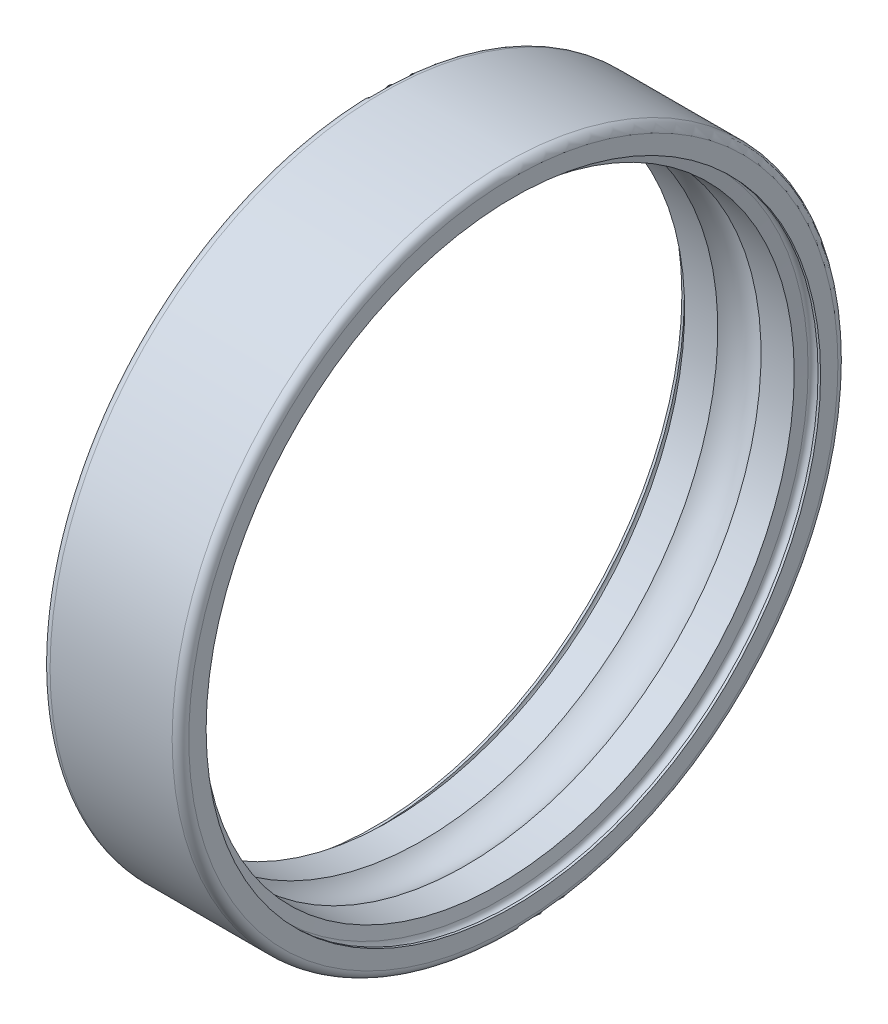
ISO-10303-21;
HEADER;
FILE_DESCRIPTION(('STEP AP214'),'2;1');
FILE_NAME('part.step','',(''),(''),'','','');
FILE_SCHEMA(('AUTOMOTIVE_DESIGN { 1 0 10303 214 1 1 1 1 }'));
ENDSEC;
DATA;
#1=APPLICATION_CONTEXT('core data for automotive mechanical design processes');
#2=APPLICATION_PROTOCOL_DEFINITION('international standard','automotive_design',2000,#1);
#3=PRODUCT_CONTEXT('',#1,'mechanical');
#4=PRODUCT('Part','Part','',(#3));
#5=PRODUCT_RELATED_PRODUCT_CATEGORY('part','',(#4));
#6=PRODUCT_DEFINITION_FORMATION('','',#4);
#7=PRODUCT_DEFINITION_CONTEXT('part definition',#1,'design');
#8=PRODUCT_DEFINITION('design','',#6,#7);
#9=PRODUCT_DEFINITION_SHAPE('','',#8);
#10=(LENGTH_UNIT() NAMED_UNIT(*) SI_UNIT(.MILLI.,.METRE.));
#11=(NAMED_UNIT(*) PLANE_ANGLE_UNIT() SI_UNIT($,.RADIAN.));
#12=(NAMED_UNIT(*) SI_UNIT($,.STERADIAN.) SOLID_ANGLE_UNIT());
#13=UNCERTAINTY_MEASURE_WITH_UNIT(LENGTH_MEASURE(1.E-05),#10,'distance_accuracy_value','');
#14=(GEOMETRIC_REPRESENTATION_CONTEXT(3) GLOBAL_UNCERTAINTY_ASSIGNED_CONTEXT((#13)) GLOBAL_UNIT_ASSIGNED_CONTEXT((#10,
#11,#12)) REPRESENTATION_CONTEXT('',''));
#15=CARTESIAN_POINT('',(0.,0.,0.));
#16=DIRECTION('',(0.,0.,1.));
#17=DIRECTION('',(1.,0.,0.));
#18=AXIS2_PLACEMENT_3D('',#15,#16,#17);
#19=CARTESIAN_POINT('',(2.5,0.,0.));
#20=DIRECTION('',(1.,0.,0.));
#21=DIRECTION('',(0.,0.,-1.));
#22=AXIS2_PLACEMENT_3D('',#19,#20,#21);
#23=TOROIDAL_SURFACE('',#22,9.75000000000001,1.1905);
#24=CARTESIAN_POINT('',(3.27928829710191,0.,0.));
#25=DIRECTION('',(-1.,0.,0.));
#26=DIRECTION('',(0.,0.,1.));
#27=AXIS2_PLACEMENT_3D('',#24,#25,#26);
#28=CIRCLE('',#27,10.65);
#29=CARTESIAN_POINT('',(3.27928829710191,0.,10.65));
#30=VERTEX_POINT('',#29);
#31=EDGE_CURVE('E123',#30,#30,#28,.F.);
#32=ORIENTED_EDGE('',*,*,#31,.T.);
#33=EDGE_LOOP('',(#32));
#34=FACE_BOUND('',#33,.T.);
#35=CARTESIAN_POINT('',(1.72071170289809,0.,0.));
#36=DIRECTION('',(-1.,0.,0.));
#37=DIRECTION('',(0.,0.,1.));
#38=AXIS2_PLACEMENT_3D('',#35,#36,#37);
#39=CIRCLE('',#38,10.65);
#40=CARTESIAN_POINT('',(1.72071170289809,0.,10.65));
#41=VERTEX_POINT('',#40);
#42=EDGE_CURVE('E128',#41,#41,#39,.T.);
#43=ORIENTED_EDGE('',*,*,#42,.T.);
#44=EDGE_LOOP('',(#43));
#45=FACE_BOUND('',#44,.T.);
#46=ADVANCED_FACE('F14',(#34,#45),#23,.F.);
#47=CARTESIAN_POINT('',(50.,0.,0.));
#48=DIRECTION('',(-1.,0.,0.));
#49=DIRECTION('',(0.,0.,1.));
#50=AXIS2_PLACEMENT_3D('',#47,#48,#49);
#51=CYLINDRICAL_SURFACE('',#50,10.65);
#52=CARTESIAN_POINT('',(0.524938966801098,0.,0.));
#53=DIRECTION('',(-1.,0.,0.));
#54=DIRECTION('',(0.,0.,1.));
#55=AXIS2_PLACEMENT_3D('',#52,#53,#54);
#56=CIRCLE('',#55,10.65);
#57=CARTESIAN_POINT('',(0.524938966801098,0.,10.65));
#58=VERTEX_POINT('',#57);
#59=EDGE_CURVE('E118',#58,#58,#56,.T.);
#60=ORIENTED_EDGE('',*,*,#59,.T.);
#61=EDGE_LOOP('',(#60));
#62=FACE_BOUND('',#61,.T.);
#63=ORIENTED_EDGE('',*,*,#42,.F.);
#64=EDGE_LOOP('',(#63));
#65=FACE_BOUND('',#64,.T.);
#66=ADVANCED_FACE('F242',(#62,#65),#51,.F.);
#67=CARTESIAN_POINT('',(50.,0.,0.));
#68=DIRECTION('',(-1.,0.,0.));
#69=DIRECTION('',(0.,0.,1.));
#70=AXIS2_PLACEMENT_3D('',#67,#68,#69);
#71=CYLINDRICAL_SURFACE('',#70,10.65);
#72=ORIENTED_EDGE('',*,*,#31,.F.);
#73=EDGE_LOOP('',(#72));
#74=FACE_BOUND('',#73,.T.);
#75=CARTESIAN_POINT('',(4.4750610331989,0.,0.));
#76=DIRECTION('',(1.,0.,0.));
#77=DIRECTION('',(0.,0.,-1.));
#78=AXIS2_PLACEMENT_3D('',#75,#76,#77);
#79=CIRCLE('',#78,10.65);
#80=CARTESIAN_POINT('',(4.4750610331989,0.,-10.65));
#81=VERTEX_POINT('',#80);
#82=EDGE_CURVE('E113',#81,#81,#79,.T.);
#83=ORIENTED_EDGE('',*,*,#82,.T.);
#84=EDGE_LOOP('',(#83));
#85=FACE_BOUND('',#84,.T.);
#86=ADVANCED_FACE('F232',(#74,#85),#71,.F.);
#87=CARTESIAN_POINT('',(0.449999999999999,0.,0.));
#88=DIRECTION('',(-1.,0.,0.));
#89=DIRECTION('',(0.,0.,1.));
#90=AXIS2_PLACEMENT_3D('',#87,#88,#89);
#91=CONICAL_SURFACE('',#90,11.075,1.39626340159546);
#92=CARTESIAN_POINT('',(0.45,0.,0.));
#93=DIRECTION('',(1.,0.,0.));
#94=DIRECTION('',(0.,0.,-1.));
#95=AXIS2_PLACEMENT_3D('',#92,#93,#94);
#96=CIRCLE('',#95,11.075);
#97=CARTESIAN_POINT('',(0.45,0.,-11.075));
#98=VERTEX_POINT('',#97);
#99=EDGE_CURVE('E107',#98,#98,#96,.F.);
#100=ORIENTED_EDGE('',*,*,#99,.T.);
#101=EDGE_LOOP('',(#100));
#102=FACE_BOUND('',#101,.T.);
#103=ORIENTED_EDGE('',*,*,#59,.F.);
#104=EDGE_LOOP('',(#103));
#105=FACE_BOUND('',#104,.T.);
#106=ADVANCED_FACE('F166',(#102,#105),#91,.F.);
#107=CARTESIAN_POINT('',(4.55,0.,0.));
#108=DIRECTION('',(1.,0.,0.));
#109=DIRECTION('',(0.,0.,-1.));
#110=AXIS2_PLACEMENT_3D('',#107,#108,#109);
#111=CONICAL_SURFACE('',#110,11.075,1.39626340159547);
#112=ORIENTED_EDGE('',*,*,#82,.F.);
#113=EDGE_LOOP('',(#112));
#114=FACE_BOUND('',#113,.T.);
#115=CARTESIAN_POINT('',(4.55,0.,0.));
#116=DIRECTION('',(1.,0.,0.));
#117=DIRECTION('',(0.,0.,-1.));
#118=AXIS2_PLACEMENT_3D('',#115,#116,#117);
#119=CIRCLE('',#118,11.075);
#120=CARTESIAN_POINT('',(4.55,0.,-11.075));
#121=VERTEX_POINT('',#120);
#122=EDGE_CURVE('E103',#121,#121,#119,.T.);
#123=ORIENTED_EDGE('',*,*,#122,.T.);
#124=EDGE_LOOP('',(#123));
#125=FACE_BOUND('',#124,.T.);
#126=ADVANCED_FACE('F160',(#114,#125),#111,.F.);
#127=CARTESIAN_POINT('',(0.27,0.,0.));
#128=DIRECTION('',(1.,0.,0.));
#129=DIRECTION('',(0.,0.,-1.));
#130=AXIS2_PLACEMENT_3D('',#127,#128,#129);
#131=TOROIDAL_SURFACE('',#130,11.075,0.18);
#132=ORIENTED_EDGE('',*,*,#99,.F.);
#133=EDGE_LOOP('',(#132));
#134=FACE_BOUND('',#133,.T.);
#135=CARTESIAN_POINT('',(0.0899999999999998,0.,0.));
#136=DIRECTION('',(-1.,0.,0.));
#137=DIRECTION('',(0.,0.,1.));
#138=AXIS2_PLACEMENT_3D('',#135,#136,#137);
#139=CIRCLE('',#138,11.075);
#140=CARTESIAN_POINT('',(0.0899999999999998,0.,11.075));
#141=VERTEX_POINT('',#140);
#142=EDGE_CURVE('E106',#141,#141,#139,.T.);
#143=ORIENTED_EDGE('',*,*,#142,.T.);
#144=EDGE_LOOP('',(#143));
#145=FACE_BOUND('',#144,.T.);
#146=ADVANCED_FACE('F94',(#134,#145),#131,.F.);
#147=CARTESIAN_POINT('',(4.73,0.,0.));
#148=DIRECTION('',(1.,0.,0.));
#149=DIRECTION('',(0.,0.,-1.));
#150=AXIS2_PLACEMENT_3D('',#147,#148,#149);
#151=TOROIDAL_SURFACE('',#150,11.075,0.18);
#152=CARTESIAN_POINT('',(4.91,0.,0.));
#153=DIRECTION('',(-1.,0.,0.));
#154=DIRECTION('',(0.,0.,1.));
#155=AXIS2_PLACEMENT_3D('',#152,#153,#154);
#156=CIRCLE('',#155,11.075);
#157=CARTESIAN_POINT('',(4.91,0.,11.075));
#158=VERTEX_POINT('',#157);
#159=EDGE_CURVE('E140',#158,#158,#156,.F.);
#160=ORIENTED_EDGE('',*,*,#159,.T.);
#161=EDGE_LOOP('',(#160));
#162=FACE_BOUND('',#161,.T.);
#163=ORIENTED_EDGE('',*,*,#122,.F.);
#164=EDGE_LOOP('',(#163));
#165=FACE_BOUND('',#164,.T.);
#166=ADVANCED_FACE('F89',(#162,#165),#151,.F.);
#167=CARTESIAN_POINT('',(50.,0.,0.));
#168=DIRECTION('',(-1.,0.,0.));
#169=DIRECTION('',(0.,0.,1.));
#170=AXIS2_PLACEMENT_3D('',#167,#168,#169);
#171=CYLINDRICAL_SURFACE('',#170,11.075);
#172=CARTESIAN_POINT('',(0.,0.,0.));
#173=DIRECTION('',(-1.,0.,0.));
#174=DIRECTION('',(0.,0.,1.));
#175=AXIS2_PLACEMENT_3D('',#172,#173,#174);
#176=CIRCLE('',#175,11.075);
#177=CARTESIAN_POINT('',(0.,0.,11.075));
#178=VERTEX_POINT('',#177);
#179=EDGE_CURVE('E18',#178,#178,#176,.F.);
#180=ORIENTED_EDGE('',*,*,#179,.F.);
#181=EDGE_LOOP('',(#180));
#182=FACE_BOUND('',#181,.T.);
#183=ORIENTED_EDGE('',*,*,#142,.F.);
#184=EDGE_LOOP('',(#183));
#185=FACE_BOUND('',#184,.T.);
#186=ADVANCED_FACE('F85',(#182,#185),#171,.F.);
#187=CARTESIAN_POINT('',(50.,0.,0.));
#188=DIRECTION('',(-1.,0.,0.));
#189=DIRECTION('',(0.,0.,1.));
#190=AXIS2_PLACEMENT_3D('',#187,#188,#189);
#191=CYLINDRICAL_SURFACE('',#190,11.075);
#192=ORIENTED_EDGE('',*,*,#159,.F.);
#193=EDGE_LOOP('',(#192));
#194=FACE_BOUND('',#193,.T.);
#195=CARTESIAN_POINT('',(5.,0.,0.));
#196=DIRECTION('',(-1.,0.,0.));
#197=DIRECTION('',(0.,0.,1.));
#198=AXIS2_PLACEMENT_3D('',#195,#196,#197);
#199=CIRCLE('',#198,11.075);
#200=CARTESIAN_POINT('',(5.,0.,11.075));
#201=VERTEX_POINT('',#200);
#202=EDGE_CURVE('E135',#201,#201,#199,.T.);
#203=ORIENTED_EDGE('',*,*,#202,.F.);
#204=EDGE_LOOP('',(#203));
#205=FACE_BOUND('',#204,.T.);
#206=ADVANCED_FACE('F81',(#194,#205),#191,.F.);
#207=CARTESIAN_POINT('',(0.,11.7,0.));
#208=DIRECTION('',(-1.,0.,0.));
#209=DIRECTION('',(0.,0.,1.));
#210=AXIS2_PLACEMENT_3D('',#207,#208,#209);
#211=PLANE('',#210);
#212=CARTESIAN_POINT('',(0.,0.,0.));
#213=DIRECTION('',(1.,0.,0.));
#214=DIRECTION('',(0.,0.,-1.));
#215=AXIS2_PLACEMENT_3D('',#212,#213,#214);
#216=CIRCLE('',#215,11.7);
#217=CARTESIAN_POINT('',(0.,0.,-11.7));
#218=VERTEX_POINT('',#217);
#219=EDGE_CURVE('E65',#218,#218,#216,.T.);
#220=ORIENTED_EDGE('',*,*,#219,.F.);
#221=EDGE_LOOP('',(#220));
#222=FACE_BOUND('',#221,.T.);
#223=ORIENTED_EDGE('',*,*,#179,.T.);
#224=EDGE_LOOP('',(#223));
#225=FACE_BOUND('',#224,.T.);
#226=ADVANCED_FACE('F71',(#222,#225),#211,.T.);
#227=CARTESIAN_POINT('',(5.,11.075,0.));
#228=DIRECTION('',(1.,0.,0.));
#229=DIRECTION('',(0.,0.,-1.));
#230=AXIS2_PLACEMENT_3D('',#227,#228,#229);
#231=PLANE('',#230);
#232=ORIENTED_EDGE('',*,*,#202,.T.);
#233=EDGE_LOOP('',(#232));
#234=FACE_BOUND('',#233,.T.);
#235=CARTESIAN_POINT('',(5.,0.,0.));
#236=DIRECTION('',(-1.,0.,0.));
#237=DIRECTION('',(0.,0.,-1.));
#238=AXIS2_PLACEMENT_3D('',#235,#236,#237);
#239=CIRCLE('',#238,11.7);
#240=CARTESIAN_POINT('',(5.,0.,-11.7));
#241=VERTEX_POINT('',#240);
#242=EDGE_CURVE('E27',#241,#241,#239,.T.);
#243=ORIENTED_EDGE('',*,*,#242,.F.);
#244=EDGE_LOOP('',(#243));
#245=FACE_BOUND('',#244,.T.);
#246=ADVANCED_FACE('F80',(#234,#245),#231,.T.);
#247=CARTESIAN_POINT('',(0.300000000000002,0.,0.));
#248=DIRECTION('',(1.,0.,0.));
#249=DIRECTION('',(0.,0.,-1.));
#250=AXIS2_PLACEMENT_3D('',#247,#248,#249);
#251=TOROIDAL_SURFACE('',#250,11.7,0.300000000000002);
#252=CARTESIAN_POINT('',(0.300000000000002,0.,0.));
#253=DIRECTION('',(-1.,0.,0.));
#254=DIRECTION('',(0.,0.,1.));
#255=AXIS2_PLACEMENT_3D('',#252,#253,#254);
#256=CIRCLE('',#255,12.);
#257=CARTESIAN_POINT('',(0.300000000000002,0.,12.));
#258=VERTEX_POINT('',#257);
#259=EDGE_CURVE('E22',#258,#258,#256,.F.);
#260=ORIENTED_EDGE('',*,*,#259,.F.);
#261=EDGE_LOOP('',(#260));
#262=FACE_BOUND('',#261,.T.);
#263=ORIENTED_EDGE('',*,*,#219,.T.);
#264=EDGE_LOOP('',(#263));
#265=FACE_BOUND('',#264,.T.);
#266=ADVANCED_FACE('F45',(#262,#265),#251,.T.);
#267=CARTESIAN_POINT('',(4.7,0.,0.));
#268=DIRECTION('',(1.,0.,0.));
#269=DIRECTION('',(0.,0.,-1.));
#270=AXIS2_PLACEMENT_3D('',#267,#268,#269);
#271=TOROIDAL_SURFACE('',#270,11.7,0.300000000000003);
#272=ORIENTED_EDGE('',*,*,#242,.T.);
#273=EDGE_LOOP('',(#272));
#274=FACE_BOUND('',#273,.T.);
#275=CARTESIAN_POINT('',(4.7,0.,0.));
#276=DIRECTION('',(-1.,0.,0.));
#277=DIRECTION('',(0.,0.,1.));
#278=AXIS2_PLACEMENT_3D('',#275,#276,#277);
#279=CIRCLE('',#278,12.);
#280=CARTESIAN_POINT('',(4.7,0.,12.));
#281=VERTEX_POINT('',#280);
#282=EDGE_CURVE('E10',#281,#281,#279,.T.);
#283=ORIENTED_EDGE('',*,*,#282,.F.);
#284=EDGE_LOOP('',(#283));
#285=FACE_BOUND('',#284,.T.);
#286=ADVANCED_FACE('F39',(#274,#285),#271,.T.);
#287=CARTESIAN_POINT('',(50.,0.,0.));
#288=DIRECTION('',(-1.,0.,0.));
#289=DIRECTION('',(0.,0.,1.));
#290=AXIS2_PLACEMENT_3D('',#287,#288,#289);
#291=CYLINDRICAL_SURFACE('',#290,12.);
#292=ORIENTED_EDGE('',*,*,#282,.T.);
#293=EDGE_LOOP('',(#292));
#294=FACE_BOUND('',#293,.T.);
#295=ORIENTED_EDGE('',*,*,#259,.T.);
#296=EDGE_LOOP('',(#295));
#297=FACE_BOUND('',#296,.T.);
#298=ADVANCED_FACE('F44',(#294,#297),#291,.T.);
#299=CLOSED_SHELL('',(#46,#66,#86,#106,#126,#146,#166,#186,#206,#226,#246,#266,#286,#298));
#300=MANIFOLD_SOLID_BREP('B1',#299);
#301=ADVANCED_BREP_SHAPE_REPRESENTATION('',(#18,#300),#14);
#302=SHAPE_DEFINITION_REPRESENTATION(#9,#301);
ENDSEC;
END-ISO-10303-21;
